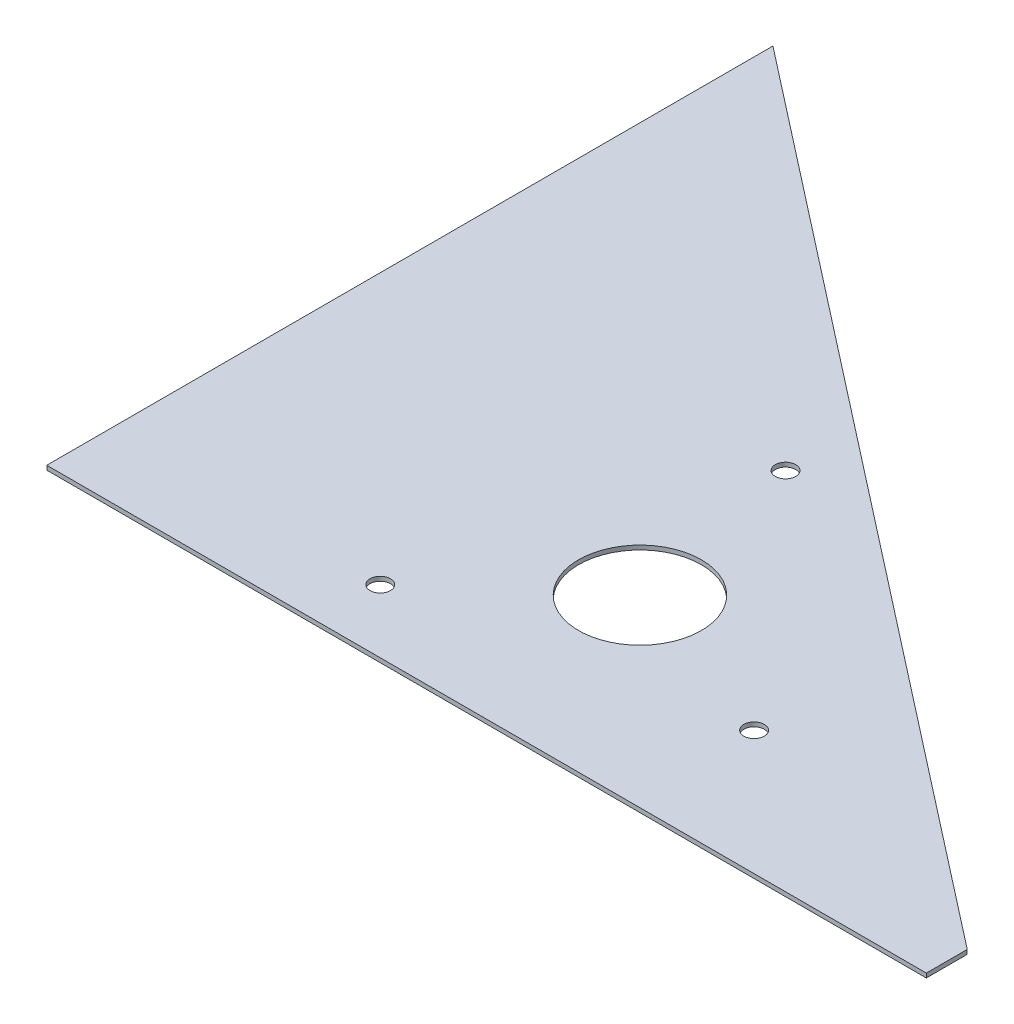
ISO-10303-21;
HEADER;
FILE_DESCRIPTION(('STEP AP214'),'2;1');
FILE_NAME('part.step','',(''),(''),'','','');
FILE_SCHEMA(('AUTOMOTIVE_DESIGN { 1 0 10303 214 1 1 1 1 }'));
ENDSEC;
DATA;
#1=APPLICATION_CONTEXT('core data for automotive mechanical design processes');
#2=APPLICATION_PROTOCOL_DEFINITION('international standard','automotive_design',2000,#1);
#3=PRODUCT_CONTEXT('',#1,'mechanical');
#4=PRODUCT('Part','Part','',(#3));
#5=PRODUCT_RELATED_PRODUCT_CATEGORY('part','',(#4));
#6=PRODUCT_DEFINITION_FORMATION('','',#4);
#7=PRODUCT_DEFINITION_CONTEXT('part definition',#1,'design');
#8=PRODUCT_DEFINITION('design','',#6,#7);
#9=PRODUCT_DEFINITION_SHAPE('','',#8);
#10=(LENGTH_UNIT() NAMED_UNIT(*) SI_UNIT(.MILLI.,.METRE.));
#11=(NAMED_UNIT(*) PLANE_ANGLE_UNIT() SI_UNIT($,.RADIAN.));
#12=(NAMED_UNIT(*) SI_UNIT($,.STERADIAN.) SOLID_ANGLE_UNIT());
#13=UNCERTAINTY_MEASURE_WITH_UNIT(LENGTH_MEASURE(1.E-05),#10,'distance_accuracy_value','');
#14=(GEOMETRIC_REPRESENTATION_CONTEXT(3) GLOBAL_UNCERTAINTY_ASSIGNED_CONTEXT((#13)) GLOBAL_UNIT_ASSIGNED_CONTEXT((#10,
#11,#12)) REPRESENTATION_CONTEXT('',''));
#15=CARTESIAN_POINT('',(0.,0.,0.));
#16=DIRECTION('',(0.,0.,1.));
#17=DIRECTION('',(1.,0.,0.));
#18=AXIS2_PLACEMENT_3D('',#15,#16,#17);
#19=CARTESIAN_POINT('',(546.1,2.65684,-25.4));
#20=DIRECTION('',(-0.614575452616154,0.,0.788858043656556));
#21=DIRECTION('',(0.788858043656556,0.,0.614575452616154));
#22=AXIS2_PLACEMENT_3D('',#19,#20,#21);
#23=PLANE('',#22);
#24=DIRECTION('',(-0.788858043656556,0.,-0.614575452616154));
#25=VECTOR('',#24,1.);
#26=CARTESIAN_POINT('',(546.1,0.,-25.4));
#27=LINE('',#26,#25);
#28=CARTESIAN_POINT('',(546.1,0.,-25.4));
#29=VERTEX_POINT('',#28);
#30=CARTESIAN_POINT('',(0.,0.,-450.85));
#31=VERTEX_POINT('',#30);
#32=EDGE_CURVE('E99',#29,#31,#27,.T.);
#33=ORIENTED_EDGE('',*,*,#32,.T.);
#34=DIRECTION('',(0.,-1.,0.));
#35=VECTOR('',#34,1.);
#36=CARTESIAN_POINT('',(0.,2.65684,-450.85));
#37=LINE('',#36,#35);
#38=CARTESIAN_POINT('',(0.,2.65684,-450.85));
#39=VERTEX_POINT('',#38);
#40=EDGE_CURVE('E11',#39,#31,#37,.T.);
#41=ORIENTED_EDGE('',*,*,#40,.F.);
#42=DIRECTION('',(-0.788858043656556,0.,-0.614575452616154));
#43=VECTOR('',#42,1.);
#44=CARTESIAN_POINT('',(546.1,2.65684,-25.4));
#45=LINE('',#44,#43);
#46=CARTESIAN_POINT('',(546.1,2.65684,-25.4));
#47=VERTEX_POINT('',#46);
#48=EDGE_CURVE('E87',#47,#39,#45,.T.);
#49=ORIENTED_EDGE('',*,*,#48,.F.);
#50=DIRECTION('',(0.,-1.,0.));
#51=VECTOR('',#50,1.);
#52=CARTESIAN_POINT('',(546.1,2.65684,-25.4));
#53=LINE('',#52,#51);
#54=EDGE_CURVE('E95',#47,#29,#53,.T.);
#55=ORIENTED_EDGE('',*,*,#54,.T.);
#56=EDGE_LOOP('',(#33,#41,#49,#55));
#57=FACE_BOUND('',#56,.T.);
#58=ADVANCED_FACE('F36',(#57),#23,.F.);
#59=CARTESIAN_POINT('',(0.,2.65684,-450.85));
#60=DIRECTION('',(1.,0.,0.));
#61=DIRECTION('',(0.,0.,-1.));
#62=AXIS2_PLACEMENT_3D('',#59,#60,#61);
#63=PLANE('',#62);
#64=DIRECTION('',(0.,0.,1.));
#65=VECTOR('',#64,1.);
#66=CARTESIAN_POINT('',(0.,0.,-450.85));
#67=LINE('',#66,#65);
#68=CARTESIAN_POINT('',(0.,0.,0.));
#69=VERTEX_POINT('',#68);
#70=EDGE_CURVE('E91',#31,#69,#67,.T.);
#71=ORIENTED_EDGE('',*,*,#70,.T.);
#72=DIRECTION('',(0.,-1.,0.));
#73=VECTOR('',#72,1.);
#74=CARTESIAN_POINT('',(0.,2.65684,0.));
#75=LINE('',#74,#73);
#76=CARTESIAN_POINT('',(0.,2.65684,0.));
#77=VERTEX_POINT('',#76);
#78=EDGE_CURVE('E44',#77,#69,#75,.T.);
#79=ORIENTED_EDGE('',*,*,#78,.F.);
#80=DIRECTION('',(0.,0.,1.));
#81=VECTOR('',#80,1.);
#82=CARTESIAN_POINT('',(0.,2.65684,-450.85));
#83=LINE('',#82,#81);
#84=EDGE_CURVE('E82',#39,#77,#83,.T.);
#85=ORIENTED_EDGE('',*,*,#84,.F.);
#86=ORIENTED_EDGE('',*,*,#40,.T.);
#87=EDGE_LOOP('',(#71,#79,#85,#86));
#88=FACE_BOUND('',#87,.T.);
#89=ADVANCED_FACE('F90',(#88),#63,.F.);
#90=CARTESIAN_POINT('',(0.,2.65684,0.));
#91=DIRECTION('',(0.,0.,-1.));
#92=DIRECTION('',(-1.,0.,0.));
#93=AXIS2_PLACEMENT_3D('',#90,#91,#92);
#94=PLANE('',#93);
#95=DIRECTION('',(1.,0.,0.));
#96=VECTOR('',#95,1.);
#97=CARTESIAN_POINT('',(0.,0.,0.));
#98=LINE('',#97,#96);
#99=CARTESIAN_POINT('',(546.1,0.,0.));
#100=VERTEX_POINT('',#99);
#101=EDGE_CURVE('E69',#69,#100,#98,.T.);
#102=ORIENTED_EDGE('',*,*,#101,.T.);
#103=DIRECTION('',(0.,-1.,0.));
#104=VECTOR('',#103,1.);
#105=CARTESIAN_POINT('',(546.1,2.65684,0.));
#106=LINE('',#105,#104);
#107=CARTESIAN_POINT('',(546.1,2.65684,0.));
#108=VERTEX_POINT('',#107);
#109=EDGE_CURVE('E92',#108,#100,#106,.T.);
#110=ORIENTED_EDGE('',*,*,#109,.F.);
#111=DIRECTION('',(1.,0.,0.));
#112=VECTOR('',#111,1.);
#113=CARTESIAN_POINT('',(0.,2.65684,0.));
#114=LINE('',#113,#112);
#115=EDGE_CURVE('E85',#77,#108,#114,.T.);
#116=ORIENTED_EDGE('',*,*,#115,.F.);
#117=ORIENTED_EDGE('',*,*,#78,.T.);
#118=EDGE_LOOP('',(#102,#110,#116,#117));
#119=FACE_BOUND('',#118,.T.);
#120=ADVANCED_FACE('F93',(#119),#94,.F.);
#121=CARTESIAN_POINT('',(546.1,2.65684,0.));
#122=DIRECTION('',(-1.,0.,0.));
#123=DIRECTION('',(0.,0.,1.));
#124=AXIS2_PLACEMENT_3D('',#121,#122,#123);
#125=PLANE('',#124);
#126=DIRECTION('',(0.,0.,-1.));
#127=VECTOR('',#126,1.);
#128=CARTESIAN_POINT('',(546.1,0.,0.));
#129=LINE('',#128,#127);
#130=EDGE_CURVE('E75',#100,#29,#129,.T.);
#131=ORIENTED_EDGE('',*,*,#130,.T.);
#132=ORIENTED_EDGE('',*,*,#54,.F.);
#133=DIRECTION('',(0.,0.,-1.));
#134=VECTOR('',#133,1.);
#135=CARTESIAN_POINT('',(546.1,2.65684,0.));
#136=LINE('',#135,#134);
#137=EDGE_CURVE('E52',#108,#47,#136,.T.);
#138=ORIENTED_EDGE('',*,*,#137,.F.);
#139=ORIENTED_EDGE('',*,*,#109,.T.);
#140=EDGE_LOOP('',(#131,#132,#138,#139));
#141=FACE_BOUND('',#140,.T.);
#142=ADVANCED_FACE('F107',(#141),#125,.F.);
#143=CARTESIAN_POINT('',(0.,2.65684,0.));
#144=DIRECTION('',(0.,1.,0.));
#145=DIRECTION('',(0.,0.,1.));
#146=AXIS2_PLACEMENT_3D('',#143,#144,#145);
#147=PLANE('',#146);
#148=CARTESIAN_POINT('',(232.190531828462,2.65684,-226.499987068068));
#149=DIRECTION('',(0.,1.,0.));
#150=DIRECTION('',(0.,0.,1.));
#151=AXIS2_PLACEMENT_3D('',#148,#149,#150);
#152=CIRCLE('',#151,6.34999999999998);
#153=CARTESIAN_POINT('',(232.190531828462,2.65684,-220.149987068068));
#154=VERTEX_POINT('',#153);
#155=EDGE_CURVE('E131',#154,#154,#152,.T.);
#156=ORIENTED_EDGE('',*,*,#155,.F.);
#157=EDGE_LOOP('',(#156));
#158=FACE_BOUND('',#157,.T.);
#159=CARTESIAN_POINT('',(167.736694980537,2.65684,-39.3124529863857));
#160=DIRECTION('',(0.,1.,0.));
#161=DIRECTION('',(0.,0.,1.));
#162=AXIS2_PLACEMENT_3D('',#159,#160,#161);
#163=CIRCLE('',#162,6.35000000000006);
#164=CARTESIAN_POINT('',(167.736694980537,2.65684,-32.9624529863856));
#165=VERTEX_POINT('',#164);
#166=EDGE_CURVE('E125',#165,#165,#163,.T.);
#167=ORIENTED_EDGE('',*,*,#166,.F.);
#168=EDGE_LOOP('',(#167));
#169=FACE_BOUND('',#168,.T.);
#170=CARTESIAN_POINT('',(362.072773191002,2.65684,-77.087559945547));
#171=DIRECTION('',(0.,1.,0.));
#172=DIRECTION('',(0.,0.,1.));
#173=AXIS2_PLACEMENT_3D('',#170,#171,#172);
#174=CIRCLE('',#173,6.35);
#175=CARTESIAN_POINT('',(362.072773191002,2.65684,-70.737559945547));
#176=VERTEX_POINT('',#175);
#177=EDGE_CURVE('E119',#176,#176,#174,.T.);
#178=ORIENTED_EDGE('',*,*,#177,.F.);
#179=EDGE_LOOP('',(#178));
#180=FACE_BOUND('',#179,.T.);
#181=CARTESIAN_POINT('',(254.,2.65684,-114.3));
#182=DIRECTION('',(0.,-1.,0.));
#183=DIRECTION('',(0.,0.,-1.));
#184=AXIS2_PLACEMENT_3D('',#181,#182,#183);
#185=CIRCLE('',#184,38.1);
#186=CARTESIAN_POINT('',(254.,2.65684,-152.4));
#187=VERTEX_POINT('',#186);
#188=EDGE_CURVE('E102',#187,#187,#185,.T.);
#189=ORIENTED_EDGE('',*,*,#188,.T.);
#190=EDGE_LOOP('',(#189));
#191=FACE_BOUND('',#190,.T.);
#192=ORIENTED_EDGE('',*,*,#48,.T.);
#193=ORIENTED_EDGE('',*,*,#84,.T.);
#194=ORIENTED_EDGE('',*,*,#115,.T.);
#195=ORIENTED_EDGE('',*,*,#137,.T.);
#196=EDGE_LOOP('',(#192,#193,#194,#195));
#197=FACE_BOUND('',#196,.T.);
#198=ADVANCED_FACE('F83',(#158,#169,#180,#191,#197),#147,.T.);
#199=CARTESIAN_POINT('',(0.,0.,0.));
#200=DIRECTION('',(0.,1.,0.));
#201=DIRECTION('',(0.,0.,1.));
#202=AXIS2_PLACEMENT_3D('',#199,#200,#201);
#203=PLANE('',#202);
#204=CARTESIAN_POINT('',(232.190531828462,0.,-226.499987068068));
#205=DIRECTION('',(0.,1.,0.));
#206=DIRECTION('',(0.,0.,1.));
#207=AXIS2_PLACEMENT_3D('',#204,#205,#206);
#208=CIRCLE('',#207,6.34999999999998);
#209=CARTESIAN_POINT('',(232.190531828462,0.,-220.149987068068));
#210=VERTEX_POINT('',#209);
#211=EDGE_CURVE('E128',#210,#210,#208,.T.);
#212=ORIENTED_EDGE('',*,*,#211,.T.);
#213=EDGE_LOOP('',(#212));
#214=FACE_BOUND('',#213,.T.);
#215=CARTESIAN_POINT('',(167.736694980537,0.,-39.3124529863857));
#216=DIRECTION('',(0.,1.,0.));
#217=DIRECTION('',(0.,0.,1.));
#218=AXIS2_PLACEMENT_3D('',#215,#216,#217);
#219=CIRCLE('',#218,6.35000000000006);
#220=CARTESIAN_POINT('',(167.736694980537,0.,-32.9624529863856));
#221=VERTEX_POINT('',#220);
#222=EDGE_CURVE('E122',#221,#221,#219,.T.);
#223=ORIENTED_EDGE('',*,*,#222,.T.);
#224=EDGE_LOOP('',(#223));
#225=FACE_BOUND('',#224,.T.);
#226=CARTESIAN_POINT('',(362.072773191002,0.,-77.087559945547));
#227=DIRECTION('',(0.,1.,0.));
#228=DIRECTION('',(0.,0.,1.));
#229=AXIS2_PLACEMENT_3D('',#226,#227,#228);
#230=CIRCLE('',#229,6.35);
#231=CARTESIAN_POINT('',(362.072773191002,0.,-70.737559945547));
#232=VERTEX_POINT('',#231);
#233=EDGE_CURVE('E116',#232,#232,#230,.T.);
#234=ORIENTED_EDGE('',*,*,#233,.T.);
#235=EDGE_LOOP('',(#234));
#236=FACE_BOUND('',#235,.T.);
#237=CARTESIAN_POINT('',(254.,0.,-114.3));
#238=DIRECTION('',(0.,-1.,0.));
#239=DIRECTION('',(0.,0.,-1.));
#240=AXIS2_PLACEMENT_3D('',#237,#238,#239);
#241=CIRCLE('',#240,38.1);
#242=CARTESIAN_POINT('',(254.,0.,-152.4));
#243=VERTEX_POINT('',#242);
#244=EDGE_CURVE('E113',#243,#243,#241,.T.);
#245=ORIENTED_EDGE('',*,*,#244,.F.);
#246=EDGE_LOOP('',(#245));
#247=FACE_BOUND('',#246,.T.);
#248=ORIENTED_EDGE('',*,*,#32,.F.);
#249=ORIENTED_EDGE('',*,*,#130,.F.);
#250=ORIENTED_EDGE('',*,*,#101,.F.);
#251=ORIENTED_EDGE('',*,*,#70,.F.);
#252=EDGE_LOOP('',(#248,#249,#250,#251));
#253=FACE_BOUND('',#252,.T.);
#254=ADVANCED_FACE('F110',(#214,#225,#236,#247,#253),#203,.F.);
#255=CARTESIAN_POINT('',(254.,2.65684,-114.3));
#256=DIRECTION('',(0.,-1.,0.));
#257=DIRECTION('',(0.,0.,-1.));
#258=AXIS2_PLACEMENT_3D('',#255,#256,#257);
#259=CYLINDRICAL_SURFACE('',#258,38.1);
#260=ORIENTED_EDGE('',*,*,#188,.F.);
#261=EDGE_LOOP('',(#260));
#262=FACE_BOUND('',#261,.T.);
#263=ORIENTED_EDGE('',*,*,#244,.T.);
#264=EDGE_LOOP('',(#263));
#265=FACE_BOUND('',#264,.T.);
#266=ADVANCED_FACE('F155',(#262,#265),#259,.F.);
#267=CARTESIAN_POINT('',(362.072773191002,0.,-77.087559945547));
#268=DIRECTION('',(0.,1.,0.));
#269=DIRECTION('',(0.,0.,1.));
#270=AXIS2_PLACEMENT_3D('',#267,#268,#269);
#271=CYLINDRICAL_SURFACE('',#270,6.35);
#272=ORIENTED_EDGE('',*,*,#233,.F.);
#273=EDGE_LOOP('',(#272));
#274=FACE_BOUND('',#273,.T.);
#275=ORIENTED_EDGE('',*,*,#177,.T.);
#276=EDGE_LOOP('',(#275));
#277=FACE_BOUND('',#276,.T.);
#278=ADVANCED_FACE('F158',(#274,#277),#271,.F.);
#279=CARTESIAN_POINT('',(167.736694980537,0.,-39.3124529863857));
#280=DIRECTION('',(0.,1.,0.));
#281=DIRECTION('',(0.,0.,1.));
#282=AXIS2_PLACEMENT_3D('',#279,#280,#281);
#283=CYLINDRICAL_SURFACE('',#282,6.35000000000006);
#284=ORIENTED_EDGE('',*,*,#222,.F.);
#285=EDGE_LOOP('',(#284));
#286=FACE_BOUND('',#285,.T.);
#287=ORIENTED_EDGE('',*,*,#166,.T.);
#288=EDGE_LOOP('',(#287));
#289=FACE_BOUND('',#288,.T.);
#290=ADVANCED_FACE('F142',(#286,#289),#283,.F.);
#291=CARTESIAN_POINT('',(232.190531828462,0.,-226.499987068068));
#292=DIRECTION('',(0.,1.,0.));
#293=DIRECTION('',(0.,0.,1.));
#294=AXIS2_PLACEMENT_3D('',#291,#292,#293);
#295=CYLINDRICAL_SURFACE('',#294,6.34999999999998);
#296=ORIENTED_EDGE('',*,*,#211,.F.);
#297=EDGE_LOOP('',(#296));
#298=FACE_BOUND('',#297,.T.);
#299=ORIENTED_EDGE('',*,*,#155,.T.);
#300=EDGE_LOOP('',(#299));
#301=FACE_BOUND('',#300,.T.);
#302=ADVANCED_FACE('F139',(#298,#301),#295,.F.);
#303=CLOSED_SHELL('',(#58,#89,#120,#142,#198,#254,#266,#278,#290,#302));
#304=MANIFOLD_SOLID_BREP('B2',#303);
#305=ADVANCED_BREP_SHAPE_REPRESENTATION('',(#18,#304),#14);
#306=SHAPE_DEFINITION_REPRESENTATION(#9,#305);
ENDSEC;
END-ISO-10303-21;
